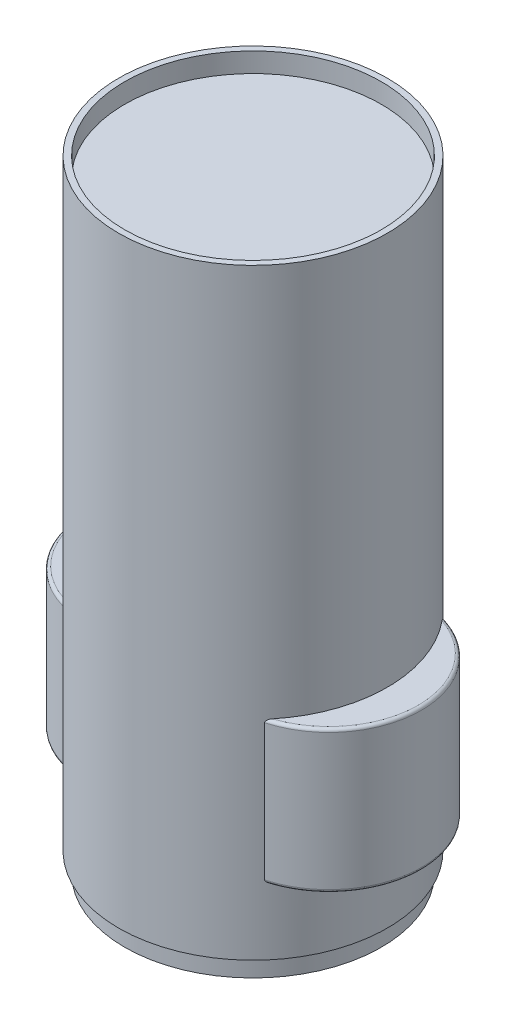
ISO-10303-21;
HEADER;
FILE_DESCRIPTION(('STEP AP214'),'2;1');
FILE_NAME('part.step','',(''),(''),'','','');
FILE_SCHEMA(('AUTOMOTIVE_DESIGN { 1 0 10303 214 1 1 1 1 }'));
ENDSEC;
DATA;
#1=APPLICATION_CONTEXT('core data for automotive mechanical design processes');
#2=APPLICATION_PROTOCOL_DEFINITION('international standard','automotive_design',2000,#1);
#3=PRODUCT_CONTEXT('',#1,'mechanical');
#4=PRODUCT('Part','Part','',(#3));
#5=PRODUCT_RELATED_PRODUCT_CATEGORY('part','',(#4));
#6=PRODUCT_DEFINITION_FORMATION('','',#4);
#7=PRODUCT_DEFINITION_CONTEXT('part definition',#1,'design');
#8=PRODUCT_DEFINITION('design','',#6,#7);
#9=PRODUCT_DEFINITION_SHAPE('','',#8);
#10=(LENGTH_UNIT() NAMED_UNIT(*) SI_UNIT(.MILLI.,.METRE.));
#11=(NAMED_UNIT(*) PLANE_ANGLE_UNIT() SI_UNIT($,.RADIAN.));
#12=(NAMED_UNIT(*) SI_UNIT($,.STERADIAN.) SOLID_ANGLE_UNIT());
#13=UNCERTAINTY_MEASURE_WITH_UNIT(LENGTH_MEASURE(1.E-05),#10,'distance_accuracy_value','');
#14=(GEOMETRIC_REPRESENTATION_CONTEXT(3) GLOBAL_UNCERTAINTY_ASSIGNED_CONTEXT((#13)) GLOBAL_UNIT_ASSIGNED_CONTEXT((#10,
#11,#12)) REPRESENTATION_CONTEXT('',''));
#15=CARTESIAN_POINT('',(0.,0.,0.));
#16=DIRECTION('',(0.,0.,1.));
#17=DIRECTION('',(1.,0.,0.));
#18=AXIS2_PLACEMENT_3D('',#15,#16,#17);
#19=CARTESIAN_POINT('',(0.,199.3,0.));
#20=DIRECTION('',(0.,1.,0.));
#21=DIRECTION('',(0.,0.,1.));
#22=AXIS2_PLACEMENT_3D('',#19,#20,#21);
#23=CYLINDRICAL_SURFACE('',#22,44.5);
#24=CARTESIAN_POINT('',(0.,205.8,0.));
#25=DIRECTION('',(0.,1.,0.));
#26=DIRECTION('',(0.,0.,1.));
#27=AXIS2_PLACEMENT_3D('',#24,#25,#26);
#28=CIRCLE('',#27,44.5);
#29=CARTESIAN_POINT('',(0.,205.8,44.5));
#30=VERTEX_POINT('',#29);
#31=EDGE_CURVE('E183',#30,#30,#28,.T.);
#32=ORIENTED_EDGE('',*,*,#31,.F.);
#33=EDGE_LOOP('',(#32));
#34=FACE_BOUND('',#33,.T.);
#35=CARTESIAN_POINT('',(0.,6.49999999999998,0.));
#36=DIRECTION('',(0.,1.,0.));
#37=DIRECTION('',(0.,0.,1.));
#38=AXIS2_PLACEMENT_3D('',#35,#36,#37);
#39=CIRCLE('',#38,44.5);
#40=CARTESIAN_POINT('',(0.,6.49999999999997,44.5));
#41=VERTEX_POINT('',#40);
#42=EDGE_CURVE('E186',#41,#41,#39,.T.);
#43=ORIENTED_EDGE('',*,*,#42,.T.);
#44=EDGE_LOOP('',(#43));
#45=FACE_BOUND('',#44,.T.);
#46=DIRECTION('',(0.,-1.,0.));
#47=VECTOR('',#46,1.);
#48=CARTESIAN_POINT('',(33.3282803180915,52.035,29.4868738770104));
#49=LINE('',#48,#47);
#50=CARTESIAN_POINT('',(33.3282803180915,74.57,29.4868738770104));
#51=VERTEX_POINT('',#50);
#52=CARTESIAN_POINT('',(33.3282803180915,29.5,29.4868738770104));
#53=VERTEX_POINT('',#52);
#54=EDGE_CURVE('E201',#51,#53,#49,.T.);
#55=ORIENTED_EDGE('',*,*,#54,.F.);
#56=CARTESIAN_POINT('',(33.3282803180915,74.57,29.4868738770104));
#57=CARTESIAN_POINT('',(33.3282290648274,74.6026941237317,29.4869303399323));
#58=CARTESIAN_POINT('',(33.3302284768937,74.6352940124547,29.4846719704872));
#59=CARTESIAN_POINT('',(33.3378637860314,74.6991919996134,29.4760393006147));
#60=CARTESIAN_POINT('',(33.3434638686415,74.7304997219744,29.4697055360972));
#61=CARTESIAN_POINT('',(33.3594192153649,74.7980036695551,29.4516436502028));
#62=CARTESIAN_POINT('',(33.370544747942,74.8337785634002,29.4390408183785));
#63=CARTESIAN_POINT('',(33.396485341139,74.9022007333026,29.409609914728));
#64=CARTESIAN_POINT('',(33.4113149859387,74.9348349226258,29.392765138918));
#65=CARTESIAN_POINT('',(33.4516346665935,75.0119389908455,29.346881596507));
#66=CARTESIAN_POINT('',(33.4787878172227,75.0543735176097,29.3159120704458));
#67=CARTESIAN_POINT('',(33.5368766703659,75.1324837514766,29.2494421360369));
#68=CARTESIAN_POINT('',(33.5678191018013,75.1681471396393,29.2139336624827));
#69=CARTESIAN_POINT('',(33.6276500485631,75.2290649353552,29.1450328354835));
#70=CARTESIAN_POINT('',(33.6562287820361,75.2550769395084,29.1120293654524));
#71=CARTESIAN_POINT('',(33.7146426992063,75.3032701830073,29.0443604457293));
#72=CARTESIAN_POINT('',(33.7444787823177,75.3254486202009,29.0096938037871));
#73=CARTESIAN_POINT('',(33.8355193205995,75.3870399433358,28.9035689894966));
#74=CARTESIAN_POINT('',(33.8980431408311,75.4213051613941,28.8302307541396));
#75=CARTESIAN_POINT('',(34.0079639573205,75.4709328743049,28.7004118095175));
#76=CARTESIAN_POINT('',(34.0550148833266,75.4888966803664,28.6445699545817));
#77=CARTESIAN_POINT('',(34.1496142551314,75.5192581407077,28.5317237699701));
#78=CARTESIAN_POINT('',(34.1971630299818,75.531651840051,28.4747186442662));
#79=CARTESIAN_POINT('',(34.2915505944723,75.5510828137592,28.360975315293));
#80=CARTESIAN_POINT('',(34.3383870002181,75.5582112864938,28.3042503438402));
#81=CARTESIAN_POINT('',(34.431898756543,75.5676543482635,28.1904201735461));
#82=CARTESIAN_POINT('',(34.478574245033,75.5699766769948,28.1333157348268));
#83=CARTESIAN_POINT('',(34.5250994035786,75.57,28.0761021363903));
#84=B_SPLINE_CURVE_WITH_KNOTS('',3,(#56,#57,#58,#59,#60,#61,#62,#63,#64,#65,#66,#67,#68,#69,#70,
#71,#72,#73,#74,#75,#76,#77,#78,#79,#80,#81,#82,#83),.UNSPECIFIED.,.F.,.F.,(4,2,2,2,2,2,2,2,2,2,
2,2,2,4),(0.,0.0977907833194195,0.194623619100568,0.312556690935294,0.430961628564803,
0.607381289542884,0.784118903501161,0.936359281983716,1.08871047450898,1.39455002030677,
1.61995867637769,1.84552712723387,2.06709051691682,2.28829682783787),.UNSPECIFIED.);
#85=CARTESIAN_POINT('',(34.5250994035785,75.57,28.0761021363903));
#86=VERTEX_POINT('',#85);
#87=EDGE_CURVE('E262',#51,#86,#84,.T.);
#88=ORIENTED_EDGE('',*,*,#87,.T.);
#89=CARTESIAN_POINT('',(0.,75.57,0.));
#90=DIRECTION('',(0.,-1.,0.));
#91=DIRECTION('',(0.,0.,-1.));
#92=AXIS2_PLACEMENT_3D('',#89,#90,#91);
#93=CIRCLE('',#92,44.5);
#94=CARTESIAN_POINT('',(34.5250994035785,75.57,-28.0761021363903));
#95=VERTEX_POINT('',#94);
#96=EDGE_CURVE('E200',#86,#95,#93,.F.);
#97=ORIENTED_EDGE('',*,*,#96,.T.);
#98=CARTESIAN_POINT('',(34.5250994035785,75.57,-28.0761021363903));
#99=CARTESIAN_POINT('',(34.471886137988,75.5699594992287,-28.1415416811893));
#100=CARTESIAN_POINT('',(34.4184661535623,75.566930112156,-28.2068487604138));
#101=CARTESIAN_POINT('',(34.3113889509015,75.5545478072244,-28.3370016309063));
#102=CARTESIAN_POINT('',(34.2577315120177,75.5451752217279,-28.4018453516787));
#103=CARTESIAN_POINT('',(34.1504178926029,75.519691929258,-28.5307911176014));
#104=CARTESIAN_POINT('',(34.0967631197051,75.5035470340788,-28.594887679342));
#105=CARTESIAN_POINT('',(33.9902994158401,75.4638607460808,-28.7213570976742));
#106=CARTESIAN_POINT('',(33.9374893288381,75.4403305713274,-28.7837324134913));
#107=CARTESIAN_POINT('',(33.8466803975093,75.3918891807662,-28.8904103855184));
#108=CARTESIAN_POINT('',(33.8083356271671,75.3688568274594,-28.9352690547207));
#109=CARTESIAN_POINT('',(33.7329920912511,75.3174471095592,-29.0230698624084));
#110=CARTESIAN_POINT('',(33.6959933682544,75.2890695760661,-29.0660119402794));
#111=CARTESIAN_POINT('',(33.6238337207307,75.2258820795504,-29.1494574891499));
#112=CARTESIAN_POINT('',(33.5886899967836,75.1910221530623,-29.1899385354299));
#113=CARTESIAN_POINT('',(33.5219136178637,75.1139527204496,-29.266599871983));
#114=CARTESIAN_POINT('',(33.4902726723159,75.0717612035702,-29.3027903325259));
#115=CARTESIAN_POINT('',(33.4442255225117,74.9974912433359,-29.3553143046088));
#116=CARTESIAN_POINT('',(33.427979634385,74.9680937562659,-29.3738095103277));
#117=CARTESIAN_POINT('',(33.3982889739881,74.9061176044222,-29.4075635929464));
#118=CARTESIAN_POINT('',(33.384844802923,74.8735382590694,-29.4228217752439));
#119=CARTESIAN_POINT('',(33.3615321712417,74.8049792472937,-29.4492527673272));
#120=CARTESIAN_POINT('',(33.3517118060886,74.7689613136333,-29.4603706432227));
#121=CARTESIAN_POINT('',(33.3369283456302,74.6947536654882,-29.4770985480268));
#122=CARTESIAN_POINT('',(33.3319471321069,74.6565726228997,-29.4827291221386));
#123=CARTESIAN_POINT('',(33.3292193392278,74.6101066554781,-29.4858124833861));
#124=CARTESIAN_POINT('',(33.3288674390376,74.6020923627154,-29.4862102513128));
#125=CARTESIAN_POINT('',(33.3283983710121,74.586053172617,-29.4867404526471));
#126=CARTESIAN_POINT('',(33.3282810559128,74.5780282851008,-29.4868730525174));
#127=CARTESIAN_POINT('',(33.3282803180915,74.57,-29.4868738770104));
#128=B_SPLINE_CURVE_WITH_KNOTS('',3,(#98,#99,#100,#101,#102,#103,#104,#105,#106,#107,#108,#109,
#110,#111,#112,#113,#114,#115,#116,#117,#118,#119,#120,#121,#122,#123,#124,#125,#126,#127),
.UNSPECIFIED.,.F.,.F.,(4,2,2,2,2,2,2,2,2,2,2,2,2,2,4),(0.,0.253023706346703,0.50683555079611,
0.761944417442202,1.0166676399544,1.20650028717804,1.39633893383444,1.5877064596561,
1.77861089874805,1.89335142921242,2.00811655592235,2.12435429681833,2.24015513641538,
2.26424639201346,2.28832251924724),.UNSPECIFIED.);
#129=CARTESIAN_POINT('',(33.3282803180915,74.57,-29.4868738770104));
#130=VERTEX_POINT('',#129);
#131=EDGE_CURVE('E268',#95,#130,#128,.T.);
#132=ORIENTED_EDGE('',*,*,#131,.T.);
#133=DIRECTION('',(0.,-1.,0.));
#134=VECTOR('',#133,1.);
#135=CARTESIAN_POINT('',(33.3282803180915,52.035,-29.4868738770104));
#136=LINE('',#135,#134);
#137=CARTESIAN_POINT('',(33.3282803180915,29.5,-29.4868738770104));
#138=VERTEX_POINT('',#137);
#139=EDGE_CURVE('E204',#138,#130,#136,.F.);
#140=ORIENTED_EDGE('',*,*,#139,.F.);
#141=CARTESIAN_POINT('',(33.3282803180915,29.5,-29.4868738770104));
#142=CARTESIAN_POINT('',(33.3282290648274,29.4673058762683,-29.4869303399324));
#143=CARTESIAN_POINT('',(33.3302284768936,29.4347059875453,-29.4846719704872));
#144=CARTESIAN_POINT('',(33.3378637860314,29.3708080003866,-29.4760393006147));
#145=CARTESIAN_POINT('',(33.3434638686415,29.3395002780256,-29.4697055360972));
#146=CARTESIAN_POINT('',(33.3594192153649,29.2719963304449,-29.4516436502028));
#147=CARTESIAN_POINT('',(33.370544747942,29.2362214365998,-29.4390408183785));
#148=CARTESIAN_POINT('',(33.396485341139,29.1677992666973,-29.409609914728));
#149=CARTESIAN_POINT('',(33.4113149859387,29.1351650773742,-29.3927651389181));
#150=CARTESIAN_POINT('',(33.4516346665935,29.0580610091545,-29.3468815965071));
#151=CARTESIAN_POINT('',(33.4787878172227,29.0156264823903,-29.3159120704458));
#152=CARTESIAN_POINT('',(33.5368766703659,28.9375162485234,-29.2494421360369));
#153=CARTESIAN_POINT('',(33.5678191018013,28.9018528603607,-29.2139336624827));
#154=CARTESIAN_POINT('',(33.6276500485631,28.8409350646448,-29.1450328354835));
#155=CARTESIAN_POINT('',(33.6562287820361,28.8149230604916,-29.1120293654524));
#156=CARTESIAN_POINT('',(33.7146426992063,28.7667298169927,-29.0443604457293));
#157=CARTESIAN_POINT('',(33.7444787823177,28.7445513797991,-29.0096938037871));
#158=CARTESIAN_POINT('',(33.8355193205995,28.6829600566642,-28.9035689894966));
#159=CARTESIAN_POINT('',(33.898043140831,28.6486948386059,-28.8302307541397));
#160=CARTESIAN_POINT('',(34.0079639573205,28.5990671256951,-28.7004118095175));
#161=CARTESIAN_POINT('',(34.0550148833266,28.5811033196336,-28.6445699545817));
#162=CARTESIAN_POINT('',(34.1496142551314,28.5507418592922,-28.5317237699702));
#163=CARTESIAN_POINT('',(34.1971630299818,28.538348159949,-28.4747186442662));
#164=CARTESIAN_POINT('',(34.2915505944723,28.5189171862408,-28.360975315293));
#165=CARTESIAN_POINT('',(34.338387000218,28.5117887135062,-28.3042503438402));
#166=CARTESIAN_POINT('',(34.431898756543,28.5023456517365,-28.1904201735462));
#167=CARTESIAN_POINT('',(34.478574245033,28.5000233230052,-28.1333157348268));
#168=CARTESIAN_POINT('',(34.5250994035785,28.5,-28.0761021363903));
#169=B_SPLINE_CURVE_WITH_KNOTS('',3,(#141,#142,#143,#144,#145,#146,#147,#148,#149,#150,#151,
#152,#153,#154,#155,#156,#157,#158,#159,#160,#161,#162,#163,#164,#165,#166,#167,#168),
.UNSPECIFIED.,.F.,.F.,(4,2,2,2,2,2,2,2,2,2,2,2,2,4),(0.,0.0977907833194221,0.194623619100572,
0.312556690935311,0.430961628564806,0.607381289542887,0.784118903501163,0.936359281983706,
1.08871047450897,1.39455002030677,1.61995867637769,1.84552712723387,2.06709051691681,
2.28829682783787),.UNSPECIFIED.);
#170=CARTESIAN_POINT('',(34.5250994035785,28.5,-28.0761021363903));
#171=VERTEX_POINT('',#170);
#172=EDGE_CURVE('E240',#138,#171,#169,.T.);
#173=ORIENTED_EDGE('',*,*,#172,.T.);
#174=CARTESIAN_POINT('',(0.,28.5,0.));
#175=DIRECTION('',(0.,-1.,0.));
#176=DIRECTION('',(0.,0.,-1.));
#177=AXIS2_PLACEMENT_3D('',#174,#175,#176);
#178=CIRCLE('',#177,44.5);
#179=CARTESIAN_POINT('',(34.5250994035786,28.5,28.0761021363903));
#180=VERTEX_POINT('',#179);
#181=EDGE_CURVE('E195',#180,#171,#178,.F.);
#182=ORIENTED_EDGE('',*,*,#181,.F.);
#183=CARTESIAN_POINT('',(34.5250994035785,28.5,28.0761021363903));
#184=CARTESIAN_POINT('',(34.4718861379881,28.5000405007713,28.1415416811893));
#185=CARTESIAN_POINT('',(34.4184661535623,28.503069887844,28.2068487604138));
#186=CARTESIAN_POINT('',(34.3113889509015,28.5154521927756,28.3370016309063));
#187=CARTESIAN_POINT('',(34.2577315120177,28.5248247782721,28.4018453516786));
#188=CARTESIAN_POINT('',(34.1504178926029,28.550308070742,28.5307911176014));
#189=CARTESIAN_POINT('',(34.0967631197051,28.5664529659212,28.594887679342));
#190=CARTESIAN_POINT('',(33.9902994158401,28.6061392539192,28.7213570976741));
#191=CARTESIAN_POINT('',(33.9374893288382,28.6296694286726,28.7837324134913));
#192=CARTESIAN_POINT('',(33.8466803975093,28.6781108192338,28.8904103855184));
#193=CARTESIAN_POINT('',(33.8083356271672,28.7011431725406,28.9352690547207));
#194=CARTESIAN_POINT('',(33.7329920912511,28.7525528904408,29.0230698624084));
#195=CARTESIAN_POINT('',(33.6959933682544,28.7809304239339,29.0660119402794));
#196=CARTESIAN_POINT('',(33.6238337207308,28.8441179204496,29.1494574891499));
#197=CARTESIAN_POINT('',(33.5886899967836,28.8789778469376,29.1899385354299));
#198=CARTESIAN_POINT('',(33.5219136178638,28.9560472795504,29.266599871983));
#199=CARTESIAN_POINT('',(33.4902726723159,28.9982387964297,29.3027903325258));
#200=CARTESIAN_POINT('',(33.4442255225117,29.0725087566641,29.3553143046088));
#201=CARTESIAN_POINT('',(33.427979634385,29.1019062437341,29.3738095103276));
#202=CARTESIAN_POINT('',(33.3982889739881,29.1638823955777,29.4075635929464));
#203=CARTESIAN_POINT('',(33.384844802923,29.1964617409306,29.4228217752438));
#204=CARTESIAN_POINT('',(33.3615321712417,29.2650207527063,29.4492527673272));
#205=CARTESIAN_POINT('',(33.3517118060886,29.3010386863667,29.4603706432227));
#206=CARTESIAN_POINT('',(33.3369283456302,29.3752463345118,29.4770985480268));
#207=CARTESIAN_POINT('',(33.3319471321069,29.4134273771003,29.4827291221386));
#208=CARTESIAN_POINT('',(33.3292193392278,29.4598933445218,29.4858124833861));
#209=CARTESIAN_POINT('',(33.3288674390376,29.4679076372845,29.4862102513128));
#210=CARTESIAN_POINT('',(33.3283983710121,29.483946827383,29.4867404526471));
#211=CARTESIAN_POINT('',(33.3282810559129,29.4919717148992,29.4868730525174));
#212=CARTESIAN_POINT('',(33.3282803180915,29.5,29.4868738770104));
#213=B_SPLINE_CURVE_WITH_KNOTS('',3,(#183,#184,#185,#186,#187,#188,#189,#190,#191,#192,#193,
#194,#195,#196,#197,#198,#199,#200,#201,#202,#203,#204,#205,#206,#207,#208,#209,#210,#211,#212),
.UNSPECIFIED.,.F.,.F.,(4,2,2,2,2,2,2,2,2,2,2,2,2,2,4),(0.,0.253023706346701,0.50683555079612,
0.761944417442207,1.0166676399544,1.20650028717802,1.39633893383443,1.58770645965609,
1.77861089874804,1.8933514292124,2.00811655592233,2.1243542968183,2.24015513641535,
2.26424639201344,2.28832251924726),.UNSPECIFIED.);
#214=EDGE_CURVE('E234',#180,#53,#213,.T.);
#215=ORIENTED_EDGE('',*,*,#214,.T.);
#216=EDGE_LOOP('',(#55,#88,#97,#132,#140,#173,#182,#215));
#217=FACE_BOUND('',#216,.T.);
#218=CARTESIAN_POINT('',(0.,175.57,0.));
#219=DIRECTION('',(0.,-1.,0.));
#220=DIRECTION('',(0.,0.,1.));
#221=AXIS2_PLACEMENT_3D('',#218,#219,#220);
#222=CIRCLE('',#221,44.5);
#223=CARTESIAN_POINT('',(-44.2097122743787,175.57,5.07457787571034));
#224=VERTEX_POINT('',#223);
#225=CARTESIAN_POINT('',(-44.2097122743787,175.57,-5.07457787571028));
#226=VERTEX_POINT('',#225);
#227=EDGE_CURVE('E403',#224,#226,#222,.T.);
#228=ORIENTED_EDGE('',*,*,#227,.F.);
#229=DIRECTION('',(0.,-1.,0.));
#230=VECTOR('',#229,1.);
#231=CARTESIAN_POINT('',(-44.2097122743787,175.57,5.07457787571032));
#232=LINE('',#231,#230);
#233=CARTESIAN_POINT('',(-44.2097122743787,75.57,5.0745778757103));
#234=VERTEX_POINT('',#233);
#235=EDGE_CURVE('E173',#224,#234,#232,.T.);
#236=ORIENTED_EDGE('',*,*,#235,.T.);
#237=CARTESIAN_POINT('',(-34.5250994035785,75.57,28.0761021363903));
#238=VERTEX_POINT('',#237);
#239=EDGE_CURVE('E210',#234,#238,#93,.F.);
#240=ORIENTED_EDGE('',*,*,#239,.T.);
#241=CARTESIAN_POINT('',(-34.5250994035785,75.57,28.0761021363903));
#242=CARTESIAN_POINT('',(-34.4718861379881,75.5699594992286,28.1415416811893));
#243=CARTESIAN_POINT('',(-34.4184661535623,75.566930112156,28.2068487604138));
#244=CARTESIAN_POINT('',(-34.3113889509015,75.5545478072243,28.3370016309063));
#245=CARTESIAN_POINT('',(-34.2577315120177,75.5451752217279,28.4018453516786));
#246=CARTESIAN_POINT('',(-34.1504178926029,75.519691929258,28.5307911176014));
#247=CARTESIAN_POINT('',(-34.0967631197051,75.5035470340788,28.594887679342));
#248=CARTESIAN_POINT('',(-33.9902994158401,75.4638607460808,28.7213570976742));
#249=CARTESIAN_POINT('',(-33.9374893288381,75.4403305713274,28.7837324134913));
#250=CARTESIAN_POINT('',(-33.8466803975093,75.3918891807662,28.8904103855184));
#251=CARTESIAN_POINT('',(-33.8083356271672,75.3688568274594,28.9352690547207));
#252=CARTESIAN_POINT('',(-33.7329920912511,75.3174471095592,29.0230698624084));
#253=CARTESIAN_POINT('',(-33.6959933682544,75.2890695760661,29.0660119402794));
#254=CARTESIAN_POINT('',(-33.6238337207308,75.2258820795504,29.1494574891499));
#255=CARTESIAN_POINT('',(-33.5886899967836,75.1910221530623,29.1899385354299));
#256=CARTESIAN_POINT('',(-33.5219136178638,75.1139527204496,29.266599871983));
#257=CARTESIAN_POINT('',(-33.4902726723159,75.0717612035703,29.3027903325258));
#258=CARTESIAN_POINT('',(-33.4442255225117,74.9974912433359,29.3553143046088));
#259=CARTESIAN_POINT('',(-33.427979634385,74.9680937562659,29.3738095103276));
#260=CARTESIAN_POINT('',(-33.3982889739881,74.9061176044223,29.4075635929464));
#261=CARTESIAN_POINT('',(-33.384844802923,74.8735382590694,29.4228217752438));
#262=CARTESIAN_POINT('',(-33.3615321712417,74.8049792472937,29.4492527673272));
#263=CARTESIAN_POINT('',(-33.3517118060886,74.7689613136333,29.4603706432227));
#264=CARTESIAN_POINT('',(-33.3369283456302,74.6947536654882,29.4770985480268));
#265=CARTESIAN_POINT('',(-33.3319471321069,74.6565726228997,29.4827291221386));
#266=CARTESIAN_POINT('',(-33.3292193392278,74.6101066554781,29.4858124833861));
#267=CARTESIAN_POINT('',(-33.3288674390376,74.6020923627155,29.4862102513128));
#268=CARTESIAN_POINT('',(-33.3283983710121,74.586053172617,29.4867404526471));
#269=CARTESIAN_POINT('',(-33.3282810559129,74.5780282851008,29.4868730525174));
#270=CARTESIAN_POINT('',(-33.3282803180915,74.57,29.4868738770104));
#271=B_SPLINE_CURVE_WITH_KNOTS('',3,(#241,#242,#243,#244,#245,#246,#247,#248,#249,#250,#251,
#252,#253,#254,#255,#256,#257,#258,#259,#260,#261,#262,#263,#264,#265,#266,#267,#268,#269,#270),
.UNSPECIFIED.,.F.,.F.,(4,2,2,2,2,2,2,2,2,2,2,2,2,2,4),(0.,0.253023706346694,0.506835550796111,
0.761944417442205,1.0166676399544,1.20650028717803,1.39633893383442,1.58770645965607,
1.77861089874802,1.89335142921238,2.0081165559223,2.1243542968183,2.24015513641536,
2.26424639201345,2.28832251924727),.UNSPECIFIED.);
#272=CARTESIAN_POINT('',(-33.3282803180915,74.57,29.4868738770104));
#273=VERTEX_POINT('',#272);
#274=EDGE_CURVE('E11',#238,#273,#271,.T.);
#275=ORIENTED_EDGE('',*,*,#274,.T.);
#276=DIRECTION('',(0.,-1.,0.));
#277=VECTOR('',#276,1.);
#278=CARTESIAN_POINT('',(-33.3282803180915,52.035,29.4868738770104));
#279=LINE('',#278,#277);
#280=CARTESIAN_POINT('',(-33.3282803180915,29.5,29.4868738770104));
#281=VERTEX_POINT('',#280);
#282=EDGE_CURVE('E213',#281,#273,#279,.F.);
#283=ORIENTED_EDGE('',*,*,#282,.F.);
#284=CARTESIAN_POINT('',(-33.3282803180915,29.5,29.4868738770104));
#285=CARTESIAN_POINT('',(-33.3282290648274,29.4673058762683,29.4869303399323));
#286=CARTESIAN_POINT('',(-33.3302284768937,29.4347059875453,29.4846719704872));
#287=CARTESIAN_POINT('',(-33.3378637860314,29.3708080003866,29.4760393006147));
#288=CARTESIAN_POINT('',(-33.3434638686415,29.3395002780256,29.4697055360972));
#289=CARTESIAN_POINT('',(-33.3594192153649,29.2719963304449,29.4516436502028));
#290=CARTESIAN_POINT('',(-33.370544747942,29.2362214365998,29.4390408183785));
#291=CARTESIAN_POINT('',(-33.396485341139,29.1677992666973,29.409609914728));
#292=CARTESIAN_POINT('',(-33.4113149859387,29.1351650773742,29.392765138918));
#293=CARTESIAN_POINT('',(-33.4516346665935,29.0580610091545,29.346881596507));
#294=CARTESIAN_POINT('',(-33.4787878172227,29.0156264823903,29.3159120704458));
#295=CARTESIAN_POINT('',(-33.5368766703659,28.9375162485234,29.2494421360369));
#296=CARTESIAN_POINT('',(-33.5678191018013,28.9018528603607,29.2139336624827));
#297=CARTESIAN_POINT('',(-33.6276500485631,28.8409350646448,29.1450328354835));
#298=CARTESIAN_POINT('',(-33.6562287820361,28.8149230604916,29.1120293654524));
#299=CARTESIAN_POINT('',(-33.7146426992063,28.7667298169927,29.0443604457293));
#300=CARTESIAN_POINT('',(-33.7444787823177,28.7445513797991,29.0096938037871));
#301=CARTESIAN_POINT('',(-33.8355193205995,28.6829600566642,28.9035689894966));
#302=CARTESIAN_POINT('',(-33.898043140831,28.6486948386059,28.8302307541397));
#303=CARTESIAN_POINT('',(-34.0079639573205,28.5990671256951,28.7004118095175));
#304=CARTESIAN_POINT('',(-34.0550148833266,28.5811033196336,28.6445699545817));
#305=CARTESIAN_POINT('',(-34.1496142551314,28.5507418592922,28.5317237699701));
#306=CARTESIAN_POINT('',(-34.1971630299818,28.538348159949,28.4747186442662));
#307=CARTESIAN_POINT('',(-34.2915505944723,28.5189171862408,28.360975315293));
#308=CARTESIAN_POINT('',(-34.3383870002181,28.5117887135062,28.3042503438402));
#309=CARTESIAN_POINT('',(-34.431898756543,28.5023456517365,28.1904201735461));
#310=CARTESIAN_POINT('',(-34.478574245033,28.5000233230052,28.1333157348268));
#311=CARTESIAN_POINT('',(-34.5250994035785,28.5,28.0761021363903));
#312=B_SPLINE_CURVE_WITH_KNOTS('',3,(#284,#285,#286,#287,#288,#289,#290,#291,#292,#293,#294,
#295,#296,#297,#298,#299,#300,#301,#302,#303,#304,#305,#306,#307,#308,#309,#310,#311),
.UNSPECIFIED.,.F.,.F.,(4,2,2,2,2,2,2,2,2,2,2,2,2,4),(0.,0.0977907833194227,0.194623619100574,
0.312556690935314,0.430961628564804,0.607381289542881,0.784118903501155,0.9363592819837,
1.08871047450897,1.39455002030675,1.61995867637767,1.84552712723386,2.06709051691681,
2.28829682783787),.UNSPECIFIED.);
#313=CARTESIAN_POINT('',(-34.5250994035786,28.5,28.0761021363903));
#314=VERTEX_POINT('',#313);
#315=EDGE_CURVE('E280',#281,#314,#312,.T.);
#316=ORIENTED_EDGE('',*,*,#315,.T.);
#317=CARTESIAN_POINT('',(-34.5250994035785,28.5,-28.0761021363903));
#318=VERTEX_POINT('',#317);
#319=EDGE_CURVE('E196',#318,#314,#178,.F.);
#320=ORIENTED_EDGE('',*,*,#319,.F.);
#321=CARTESIAN_POINT('',(-34.5250994035785,28.5,-28.0761021363903));
#322=CARTESIAN_POINT('',(-34.471886137988,28.5000405007713,-28.1415416811893));
#323=CARTESIAN_POINT('',(-34.4184661535623,28.503069887844,-28.2068487604138));
#324=CARTESIAN_POINT('',(-34.3113889509015,28.5154521927757,-28.3370016309063));
#325=CARTESIAN_POINT('',(-34.2577315120177,28.5248247782721,-28.4018453516787));
#326=CARTESIAN_POINT('',(-34.1504178926029,28.550308070742,-28.5307911176014));
#327=CARTESIAN_POINT('',(-34.0967631197051,28.5664529659212,-28.594887679342));
#328=CARTESIAN_POINT('',(-33.9902994158401,28.6061392539192,-28.7213570976742));
#329=CARTESIAN_POINT('',(-33.9374893288381,28.6296694286726,-28.7837324134913));
#330=CARTESIAN_POINT('',(-33.8466803975093,28.6781108192338,-28.8904103855184));
#331=CARTESIAN_POINT('',(-33.8083356271671,28.7011431725406,-28.9352690547207));
#332=CARTESIAN_POINT('',(-33.7329920912511,28.7525528904408,-29.0230698624084));
#333=CARTESIAN_POINT('',(-33.6959933682544,28.7809304239339,-29.0660119402794));
#334=CARTESIAN_POINT('',(-33.6238337207307,28.8441179204496,-29.1494574891499));
#335=CARTESIAN_POINT('',(-33.5886899967836,28.8789778469377,-29.1899385354299));
#336=CARTESIAN_POINT('',(-33.5219136178637,28.9560472795504,-29.266599871983));
#337=CARTESIAN_POINT('',(-33.4902726723159,28.9982387964297,-29.3027903325259));
#338=CARTESIAN_POINT('',(-33.4442255225117,29.0725087566641,-29.3553143046088));
#339=CARTESIAN_POINT('',(-33.427979634385,29.1019062437342,-29.3738095103277));
#340=CARTESIAN_POINT('',(-33.3982889739881,29.1638823955778,-29.4075635929464));
#341=CARTESIAN_POINT('',(-33.384844802923,29.1964617409306,-29.4228217752439));
#342=CARTESIAN_POINT('',(-33.3615321712417,29.2650207527063,-29.4492527673272));
#343=CARTESIAN_POINT('',(-33.3517118060886,29.3010386863667,-29.4603706432227));
#344=CARTESIAN_POINT('',(-33.3369283456302,29.3752463345118,-29.4770985480269));
#345=CARTESIAN_POINT('',(-33.3319471321069,29.4134273771003,-29.4827291221386));
#346=CARTESIAN_POINT('',(-33.3292193392278,29.4598933445219,-29.4858124833861));
#347=CARTESIAN_POINT('',(-33.3288674390376,29.4679076372846,-29.4862102513128));
#348=CARTESIAN_POINT('',(-33.3283983710121,29.483946827383,-29.4867404526471));
#349=CARTESIAN_POINT('',(-33.3282810559128,29.4919717148992,-29.4868730525174));
#350=CARTESIAN_POINT('',(-33.3282803180915,29.5,-29.4868738770104));
#351=B_SPLINE_CURVE_WITH_KNOTS('',3,(#321,#322,#323,#324,#325,#326,#327,#328,#329,#330,#331,
#332,#333,#334,#335,#336,#337,#338,#339,#340,#341,#342,#343,#344,#345,#346,#347,#348,#349,#350),
.UNSPECIFIED.,.F.,.F.,(4,2,2,2,2,2,2,2,2,2,2,2,2,2,4),(0.,0.253023706346706,0.50683555079611,
0.761944417442204,1.0166676399544,1.20650028717803,1.39633893383444,1.5877064596561,
1.77861089874805,1.89335142921242,2.00811655592234,2.12435429681832,2.24015513641538,
2.26424639201346,2.28832251924726),.UNSPECIFIED.);
#352=CARTESIAN_POINT('',(-33.3282803180915,29.5,-29.4868738770104));
#353=VERTEX_POINT('',#352);
#354=EDGE_CURVE('E274',#318,#353,#351,.T.);
#355=ORIENTED_EDGE('',*,*,#354,.T.);
#356=DIRECTION('',(0.,-1.,0.));
#357=VECTOR('',#356,1.);
#358=CARTESIAN_POINT('',(-33.3282803180915,52.035,-29.4868738770104));
#359=LINE('',#358,#357);
#360=CARTESIAN_POINT('',(-33.3282803180915,74.57,-29.4868738770104));
#361=VERTEX_POINT('',#360);
#362=EDGE_CURVE('E199',#361,#353,#359,.T.);
#363=ORIENTED_EDGE('',*,*,#362,.F.);
#364=CARTESIAN_POINT('',(-33.3282803180915,74.57,-29.4868738770104));
#365=CARTESIAN_POINT('',(-33.3282290648274,74.6026941237317,-29.4869303399323));
#366=CARTESIAN_POINT('',(-33.3302284768936,74.6352940124547,-29.4846719704872));
#367=CARTESIAN_POINT('',(-33.3378637860314,74.6991919996134,-29.4760393006147));
#368=CARTESIAN_POINT('',(-33.3434638686415,74.7304997219744,-29.4697055360972));
#369=CARTESIAN_POINT('',(-33.3594192153649,74.7980036695551,-29.4516436502028));
#370=CARTESIAN_POINT('',(-33.370544747942,74.8337785634002,-29.4390408183785));
#371=CARTESIAN_POINT('',(-33.396485341139,74.9022007333026,-29.409609914728));
#372=CARTESIAN_POINT('',(-33.4113149859387,74.9348349226258,-29.3927651389181));
#373=CARTESIAN_POINT('',(-33.4516346665934,75.0119389908455,-29.3468815965071));
#374=CARTESIAN_POINT('',(-33.4787878172227,75.0543735176097,-29.3159120704458));
#375=CARTESIAN_POINT('',(-33.5368766703659,75.1324837514765,-29.2494421360369));
#376=CARTESIAN_POINT('',(-33.5678191018012,75.1681471396393,-29.2139336624827));
#377=CARTESIAN_POINT('',(-33.6276500485631,75.2290649353552,-29.1450328354835));
#378=CARTESIAN_POINT('',(-33.6562287820361,75.2550769395084,-29.1120293654524));
#379=CARTESIAN_POINT('',(-33.7146426992063,75.3032701830073,-29.0443604457293));
#380=CARTESIAN_POINT('',(-33.7444787823177,75.3254486202009,-29.0096938037871));
#381=CARTESIAN_POINT('',(-33.8355193205995,75.3870399433358,-28.9035689894966));
#382=CARTESIAN_POINT('',(-33.898043140831,75.4213051613941,-28.8302307541397));
#383=CARTESIAN_POINT('',(-34.0079639573205,75.4709328743049,-28.7004118095175));
#384=CARTESIAN_POINT('',(-34.0550148833266,75.4888966803664,-28.6445699545818));
#385=CARTESIAN_POINT('',(-34.1496142551313,75.5192581407077,-28.5317237699702));
#386=CARTESIAN_POINT('',(-34.1971630299818,75.531651840051,-28.4747186442663));
#387=CARTESIAN_POINT('',(-34.2915505944723,75.5510828137592,-28.360975315293));
#388=CARTESIAN_POINT('',(-34.338387000218,75.5582112864938,-28.3042503438402));
#389=CARTESIAN_POINT('',(-34.431898756543,75.5676543482635,-28.1904201735462));
#390=CARTESIAN_POINT('',(-34.478574245033,75.5699766769948,-28.1333157348268));
#391=CARTESIAN_POINT('',(-34.5250994035785,75.57,-28.0761021363903));
#392=B_SPLINE_CURVE_WITH_KNOTS('',3,(#364,#365,#366,#367,#368,#369,#370,#371,#372,#373,#374,
#375,#376,#377,#378,#379,#380,#381,#382,#383,#384,#385,#386,#387,#388,#389,#390,#391),
.UNSPECIFIED.,.F.,.F.,(4,2,2,2,2,2,2,2,2,2,2,2,2,4),(0.,0.0977907833194186,0.194623619100568,
0.312556690935294,0.430961628564792,0.607381289542852,0.784118903501126,0.936359281983668,
1.08871047450892,1.39455002030671,1.61995867637765,1.84552712723384,2.0670905169168,
2.28829682783787),.UNSPECIFIED.);
#393=CARTESIAN_POINT('',(-34.5250994035785,75.57,-28.0761021363903));
#394=VERTEX_POINT('',#393);
#395=EDGE_CURVE('E44',#361,#394,#392,.T.);
#396=ORIENTED_EDGE('',*,*,#395,.T.);
#397=CARTESIAN_POINT('',(-44.2097122743787,75.57,-5.07457787571029));
#398=VERTEX_POINT('',#397);
#399=EDGE_CURVE('E207',#394,#398,#93,.F.);
#400=ORIENTED_EDGE('',*,*,#399,.T.);
#401=DIRECTION('',(0.,-1.,0.));
#402=VECTOR('',#401,1.);
#403=CARTESIAN_POINT('',(-44.2097122743787,175.57,-5.07457787571028));
#404=LINE('',#403,#402);
#405=EDGE_CURVE('E170',#226,#398,#404,.T.);
#406=ORIENTED_EDGE('',*,*,#405,.F.);
#407=EDGE_LOOP('',(#228,#236,#240,#275,#283,#316,#320,#355,#363,#396,#400,#406));
#408=FACE_BOUND('',#407,.T.);
#409=ADVANCED_FACE('F31',(#34,#45,#217,#408),#23,.T.);
#410=CARTESIAN_POINT('',(0.,75.57,0.));
#411=DIRECTION('',(0.,-1.,0.));
#412=DIRECTION('',(0.,0.,-1.));
#413=AXIS2_PLACEMENT_3D('',#410,#411,#412);
#414=PLANE('',#413);
#415=ORIENTED_EDGE('',*,*,#399,.F.);
#416=CARTESIAN_POINT('',(-25.15,75.57,0.));
#417=DIRECTION('',(0.,-1.,0.));
#418=DIRECTION('',(0.,0.,-1.));
#419=AXIS2_PLACEMENT_3D('',#416,#417,#418);
#420=CIRCLE('',#419,29.6);
#421=EDGE_CURVE('E51',#394,#238,#420,.F.);
#422=ORIENTED_EDGE('',*,*,#421,.T.);
#423=ORIENTED_EDGE('',*,*,#239,.F.);
#424=CARTESIAN_POINT('',(-44.5574291124918,75.57,5.11449028596872));
#425=DIRECTION('',(0.,-1.,0.));
#426=DIRECTION('',(0.,0.,-1.));
#427=AXIS2_PLACEMENT_3D('',#424,#425,#426);
#428=CIRCLE('',#427,0.350000000000008);
#429=CARTESIAN_POINT('',(-44.9068017265158,75.57,5.0935432916723));
#430=VERTEX_POINT('',#429);
#431=EDGE_CURVE('E140',#430,#234,#428,.T.);
#432=ORIENTED_EDGE('',*,*,#431,.F.);
#433=CARTESIAN_POINT('',(-46.467,75.57,5.00000000000001));
#434=DIRECTION('',(0.,1.,0.));
#435=DIRECTION('',(0.,0.,-1.));
#436=AXIS2_PLACEMENT_3D('',#433,#434,#435);
#437=CIRCLE('',#436,1.563);
#438=CARTESIAN_POINT('',(-48.03,75.57,5.00000000000001));
#439=VERTEX_POINT('',#438);
#440=EDGE_CURVE('E134',#439,#430,#437,.T.);
#441=ORIENTED_EDGE('',*,*,#440,.F.);
#442=DIRECTION('',(0.,0.,1.));
#443=VECTOR('',#442,1.);
#444=CARTESIAN_POINT('',(-48.03,75.57,5.00000000000001));
#445=LINE('',#444,#443);
#446=CARTESIAN_POINT('',(-48.03,75.57,-4.99999999999999));
#447=VERTEX_POINT('',#446);
#448=EDGE_CURVE('E137',#447,#439,#445,.T.);
#449=ORIENTED_EDGE('',*,*,#448,.F.);
#450=CARTESIAN_POINT('',(-46.467,75.57,-4.99999999999999));
#451=DIRECTION('',(0.,1.,0.));
#452=DIRECTION('',(0.,0.,-1.));
#453=AXIS2_PLACEMENT_3D('',#450,#451,#452);
#454=CIRCLE('',#453,1.563);
#455=CARTESIAN_POINT('',(-44.9068017265158,75.57,-5.09354329167228));
#456=VERTEX_POINT('',#455);
#457=EDGE_CURVE('E156',#456,#447,#454,.T.);
#458=ORIENTED_EDGE('',*,*,#457,.F.);
#459=CARTESIAN_POINT('',(-44.5574291124918,75.57,-5.11449028596869));
#460=DIRECTION('',(0.,-1.,0.));
#461=DIRECTION('',(0.,0.,1.));
#462=AXIS2_PLACEMENT_3D('',#459,#460,#461);
#463=CIRCLE('',#462,0.350000000000008);
#464=EDGE_CURVE('E393',#398,#456,#463,.T.);
#465=ORIENTED_EDGE('',*,*,#464,.F.);
#466=EDGE_LOOP('',(#415,#422,#423,#432,#441,#449,#458,#465));
#467=FACE_BOUND('',#466,.T.);
#468=ADVANCED_FACE('F136',(#467),#414,.F.);
#469=CARTESIAN_POINT('',(0.,0.,0.));
#470=DIRECTION('',(0.,-1.,0.));
#471=DIRECTION('',(0.,0.,-1.));
#472=AXIS2_PLACEMENT_3D('',#469,#470,#471);
#473=PLANE('',#472);
#474=CARTESIAN_POINT('',(0.,0.,0.));
#475=DIRECTION('',(0.,1.,0.));
#476=DIRECTION('',(0.,0.,1.));
#477=AXIS2_PLACEMENT_3D('',#474,#475,#476);
#478=CIRCLE('',#477,42.5);
#479=CARTESIAN_POINT('',(0.,0.,42.5));
#480=VERTEX_POINT('',#479);
#481=EDGE_CURVE('E192',#480,#480,#478,.T.);
#482=ORIENTED_EDGE('',*,*,#481,.F.);
#483=EDGE_LOOP('',(#482));
#484=FACE_BOUND('',#483,.T.);
#485=ADVANCED_FACE('F33',(#484),#473,.T.);
#486=CARTESIAN_POINT('',(0.,199.3,0.));
#487=DIRECTION('',(0.,1.,0.));
#488=DIRECTION('',(0.,0.,1.));
#489=AXIS2_PLACEMENT_3D('',#486,#487,#488);
#490=CYLINDRICAL_SURFACE('',#489,42.5);
#491=ORIENTED_EDGE('',*,*,#481,.T.);
#492=EDGE_LOOP('',(#491));
#493=FACE_BOUND('',#492,.T.);
#494=CARTESIAN_POINT('',(0.,6.50000000000001,0.));
#495=DIRECTION('',(0.,1.,0.));
#496=DIRECTION('',(0.,0.,1.));
#497=AXIS2_PLACEMENT_3D('',#494,#495,#496);
#498=CIRCLE('',#497,42.5);
#499=CARTESIAN_POINT('',(0.,6.5,42.5));
#500=VERTEX_POINT('',#499);
#501=EDGE_CURVE('E189',#500,#500,#498,.T.);
#502=ORIENTED_EDGE('',*,*,#501,.F.);
#503=EDGE_LOOP('',(#502));
#504=FACE_BOUND('',#503,.T.);
#505=ADVANCED_FACE('F357',(#493,#504),#490,.T.);
#506=CARTESIAN_POINT('',(0.,6.49999999999999,42.5));
#507=DIRECTION('',(0.,-1.,0.));
#508=DIRECTION('',(0.,0.,-1.));
#509=AXIS2_PLACEMENT_3D('',#506,#507,#508);
#510=PLANE('',#509);
#511=ORIENTED_EDGE('',*,*,#501,.T.);
#512=EDGE_LOOP('',(#511));
#513=FACE_BOUND('',#512,.T.);
#514=ORIENTED_EDGE('',*,*,#42,.F.);
#515=EDGE_LOOP('',(#514));
#516=FACE_BOUND('',#515,.T.);
#517=ADVANCED_FACE('F256',(#513,#516),#510,.T.);
#518=CARTESIAN_POINT('',(0.,205.8,44.5));
#519=DIRECTION('',(0.,1.,0.));
#520=DIRECTION('',(0.,0.,1.));
#521=AXIS2_PLACEMENT_3D('',#518,#519,#520);
#522=PLANE('',#521);
#523=ORIENTED_EDGE('',*,*,#31,.T.);
#524=EDGE_LOOP('',(#523));
#525=FACE_BOUND('',#524,.T.);
#526=CARTESIAN_POINT('',(0.,205.8,0.));
#527=DIRECTION('',(0.,1.,0.));
#528=DIRECTION('',(0.,0.,1.));
#529=AXIS2_PLACEMENT_3D('',#526,#527,#528);
#530=CIRCLE('',#529,42.5);
#531=CARTESIAN_POINT('',(0.,205.8,42.5));
#532=VERTEX_POINT('',#531);
#533=EDGE_CURVE('E180',#532,#532,#530,.T.);
#534=ORIENTED_EDGE('',*,*,#533,.F.);
#535=EDGE_LOOP('',(#534));
#536=FACE_BOUND('',#535,.T.);
#537=ADVANCED_FACE('F254',(#525,#536),#522,.T.);
#538=CARTESIAN_POINT('',(0.,199.3,0.));
#539=DIRECTION('',(0.,1.,0.));
#540=DIRECTION('',(0.,0.,1.));
#541=AXIS2_PLACEMENT_3D('',#538,#539,#540);
#542=CYLINDRICAL_SURFACE('',#541,42.5);
#543=ORIENTED_EDGE('',*,*,#533,.T.);
#544=EDGE_LOOP('',(#543));
#545=FACE_BOUND('',#544,.T.);
#546=CARTESIAN_POINT('',(0.,199.3,0.));
#547=DIRECTION('',(0.,1.,0.));
#548=DIRECTION('',(0.,0.,1.));
#549=AXIS2_PLACEMENT_3D('',#546,#547,#548);
#550=CIRCLE('',#549,42.5);
#551=CARTESIAN_POINT('',(0.,199.3,42.5));
#552=VERTEX_POINT('',#551);
#553=EDGE_CURVE('E177',#552,#552,#550,.T.);
#554=ORIENTED_EDGE('',*,*,#553,.F.);
#555=EDGE_LOOP('',(#554));
#556=FACE_BOUND('',#555,.T.);
#557=ADVANCED_FACE('F342',(#545,#556),#542,.F.);
#558=CARTESIAN_POINT('',(0.,199.3,42.5));
#559=DIRECTION('',(0.,1.,0.));
#560=DIRECTION('',(0.,0.,1.));
#561=AXIS2_PLACEMENT_3D('',#558,#559,#560);
#562=PLANE('',#561);
#563=ORIENTED_EDGE('',*,*,#553,.T.);
#564=EDGE_LOOP('',(#563));
#565=FACE_BOUND('',#564,.T.);
#566=ADVANCED_FACE('F340',(#565),#562,.T.);
#567=ORIENTED_EDGE('',*,*,#96,.F.);
#568=CARTESIAN_POINT('',(25.15,75.57,0.));
#569=DIRECTION('',(0.,-1.,0.));
#570=DIRECTION('',(0.,0.,-1.));
#571=AXIS2_PLACEMENT_3D('',#568,#569,#570);
#572=CIRCLE('',#571,29.6);
#573=EDGE_CURVE('E223',#86,#95,#572,.F.);
#574=ORIENTED_EDGE('',*,*,#573,.T.);
#575=EDGE_LOOP('',(#567,#574));
#576=FACE_BOUND('',#575,.T.);
#577=ADVANCED_FACE('F334',(#576),#414,.F.);
#578=CARTESIAN_POINT('',(0.,28.5,0.));
#579=DIRECTION('',(0.,-1.,0.));
#580=DIRECTION('',(0.,0.,-1.));
#581=AXIS2_PLACEMENT_3D('',#578,#579,#580);
#582=PLANE('',#581);
#583=ORIENTED_EDGE('',*,*,#181,.T.);
#584=CARTESIAN_POINT('',(25.15,28.5,0.));
#585=DIRECTION('',(0.,-1.,0.));
#586=DIRECTION('',(0.,0.,-1.));
#587=AXIS2_PLACEMENT_3D('',#584,#585,#586);
#588=CIRCLE('',#587,29.6);
#589=EDGE_CURVE('E209',#171,#180,#588,.T.);
#590=ORIENTED_EDGE('',*,*,#589,.T.);
#591=EDGE_LOOP('',(#583,#590));
#592=FACE_BOUND('',#591,.T.);
#593=ADVANCED_FACE('F321',(#592),#582,.T.);
#594=CARTESIAN_POINT('',(25.15,75.57,0.));
#595=DIRECTION('',(0.,-1.,0.));
#596=DIRECTION('',(0.,0.,-1.));
#597=AXIS2_PLACEMENT_3D('',#594,#595,#596);
#598=CYLINDRICAL_SURFACE('',#597,30.6);
#599=ORIENTED_EDGE('',*,*,#54,.T.);
#600=CARTESIAN_POINT('',(25.15,29.5,0.));
#601=DIRECTION('',(0.,-1.,0.));
#602=DIRECTION('',(0.,0.,-1.));
#603=AXIS2_PLACEMENT_3D('',#600,#601,#602);
#604=CIRCLE('',#603,30.6);
#605=EDGE_CURVE('E221',#53,#138,#604,.F.);
#606=ORIENTED_EDGE('',*,*,#605,.T.);
#607=ORIENTED_EDGE('',*,*,#139,.T.);
#608=CARTESIAN_POINT('',(25.15,74.57,0.));
#609=DIRECTION('',(0.,-1.,0.));
#610=DIRECTION('',(0.,0.,-1.));
#611=AXIS2_PLACEMENT_3D('',#608,#609,#610);
#612=CIRCLE('',#611,30.6);
#613=EDGE_CURVE('E218',#130,#51,#612,.T.);
#614=ORIENTED_EDGE('',*,*,#613,.T.);
#615=EDGE_LOOP('',(#599,#606,#607,#614));
#616=FACE_BOUND('',#615,.T.);
#617=ADVANCED_FACE('F323',(#616),#598,.T.);
#618=ORIENTED_EDGE('',*,*,#319,.T.);
#619=CARTESIAN_POINT('',(-25.15,28.5,0.));
#620=DIRECTION('',(0.,-1.,0.));
#621=DIRECTION('',(0.,0.,-1.));
#622=AXIS2_PLACEMENT_3D('',#619,#620,#621);
#623=CIRCLE('',#622,29.6);
#624=EDGE_CURVE('E225',#314,#318,#623,.T.);
#625=ORIENTED_EDGE('',*,*,#624,.T.);
#626=EDGE_LOOP('',(#618,#625));
#627=FACE_BOUND('',#626,.T.);
#628=ADVANCED_FACE('F325',(#627),#582,.T.);
#629=CARTESIAN_POINT('',(-25.15,75.57,0.));
#630=DIRECTION('',(0.,-1.,0.));
#631=DIRECTION('',(0.,0.,-1.));
#632=AXIS2_PLACEMENT_3D('',#629,#630,#631);
#633=CYLINDRICAL_SURFACE('',#632,30.6);
#634=ORIENTED_EDGE('',*,*,#362,.T.);
#635=CARTESIAN_POINT('',(-25.15,29.5,0.));
#636=DIRECTION('',(0.,-1.,0.));
#637=DIRECTION('',(0.,0.,-1.));
#638=AXIS2_PLACEMENT_3D('',#635,#636,#637);
#639=CIRCLE('',#638,30.6);
#640=EDGE_CURVE('E231',#353,#281,#639,.F.);
#641=ORIENTED_EDGE('',*,*,#640,.T.);
#642=ORIENTED_EDGE('',*,*,#282,.T.);
#643=CARTESIAN_POINT('',(-25.15,74.57,0.));
#644=DIRECTION('',(0.,-1.,0.));
#645=DIRECTION('',(0.,0.,-1.));
#646=AXIS2_PLACEMENT_3D('',#643,#644,#645);
#647=CIRCLE('',#646,30.6);
#648=EDGE_CURVE('E228',#273,#361,#647,.T.);
#649=ORIENTED_EDGE('',*,*,#648,.T.);
#650=EDGE_LOOP('',(#634,#641,#642,#649));
#651=FACE_BOUND('',#650,.T.);
#652=ADVANCED_FACE('F331',(#651),#633,.T.);
#653=CARTESIAN_POINT('',(-46.467,175.57,5.00000000000003));
#654=DIRECTION('',(0.,-1.,0.));
#655=DIRECTION('',(0.,0.,-1.));
#656=AXIS2_PLACEMENT_3D('',#653,#654,#655);
#657=CYLINDRICAL_SURFACE('',#656,1.563);
#658=ORIENTED_EDGE('',*,*,#440,.T.);
#659=DIRECTION('',(0.,-1.,0.));
#660=VECTOR('',#659,1.);
#661=CARTESIAN_POINT('',(-44.9068017265158,175.57,5.09354329167232));
#662=LINE('',#661,#660);
#663=CARTESIAN_POINT('',(-44.9068017265158,175.57,5.09354329167232));
#664=VERTEX_POINT('',#663);
#665=EDGE_CURVE('E175',#664,#430,#662,.T.);
#666=ORIENTED_EDGE('',*,*,#665,.F.);
#667=CARTESIAN_POINT('',(-46.467,175.57,5.00000000000003));
#668=DIRECTION('',(0.,1.,0.));
#669=DIRECTION('',(0.,0.,-1.));
#670=AXIS2_PLACEMENT_3D('',#667,#668,#669);
#671=CIRCLE('',#670,1.563);
#672=CARTESIAN_POINT('',(-48.03,175.57,5.00000000000003));
#673=VERTEX_POINT('',#672);
#674=EDGE_CURVE('E155',#673,#664,#671,.T.);
#675=ORIENTED_EDGE('',*,*,#674,.F.);
#676=DIRECTION('',(0.,-1.,0.));
#677=VECTOR('',#676,1.);
#678=CARTESIAN_POINT('',(-48.03,175.57,5.00000000000003));
#679=LINE('',#678,#677);
#680=EDGE_CURVE('E151',#673,#439,#679,.T.);
#681=ORIENTED_EDGE('',*,*,#680,.T.);
#682=EDGE_LOOP('',(#658,#666,#675,#681));
#683=FACE_BOUND('',#682,.T.);
#684=ADVANCED_FACE('F158',(#683),#657,.T.);
#685=CARTESIAN_POINT('',(-44.5574291124918,175.57,5.11449028596873));
#686=DIRECTION('',(0.,-1.,0.));
#687=DIRECTION('',(0.,0.,-1.));
#688=AXIS2_PLACEMENT_3D('',#685,#686,#687);
#689=CYLINDRICAL_SURFACE('',#688,0.350000000000008);
#690=ORIENTED_EDGE('',*,*,#431,.T.);
#691=ORIENTED_EDGE('',*,*,#235,.F.);
#692=CARTESIAN_POINT('',(-44.5574291124918,175.57,5.11449028596873));
#693=DIRECTION('',(0.,-1.,0.));
#694=DIRECTION('',(0.,0.,-1.));
#695=AXIS2_PLACEMENT_3D('',#692,#693,#694);
#696=CIRCLE('',#695,0.350000000000008);
#697=EDGE_CURVE('E400',#664,#224,#696,.T.);
#698=ORIENTED_EDGE('',*,*,#697,.F.);
#699=ORIENTED_EDGE('',*,*,#665,.T.);
#700=EDGE_LOOP('',(#690,#691,#698,#699));
#701=FACE_BOUND('',#700,.T.);
#702=ADVANCED_FACE('F392',(#701),#689,.F.);
#703=CARTESIAN_POINT('',(-44.5574291124918,175.57,-5.11449028596868));
#704=DIRECTION('',(0.,-1.,0.));
#705=DIRECTION('',(0.,0.,-1.));
#706=AXIS2_PLACEMENT_3D('',#703,#704,#705);
#707=CYLINDRICAL_SURFACE('',#706,0.350000000000008);
#708=ORIENTED_EDGE('',*,*,#464,.T.);
#709=DIRECTION('',(0.,-1.,0.));
#710=VECTOR('',#709,1.);
#711=CARTESIAN_POINT('',(-44.9068017265158,175.57,-5.09354329167226));
#712=LINE('',#711,#710);
#713=CARTESIAN_POINT('',(-44.9068017265158,175.57,-5.09354329167226));
#714=VERTEX_POINT('',#713);
#715=EDGE_CURVE('E162',#714,#456,#712,.T.);
#716=ORIENTED_EDGE('',*,*,#715,.F.);
#717=CARTESIAN_POINT('',(-44.5574291124918,175.57,-5.11449028596868));
#718=DIRECTION('',(0.,-1.,0.));
#719=DIRECTION('',(0.,0.,1.));
#720=AXIS2_PLACEMENT_3D('',#717,#718,#719);
#721=CIRCLE('',#720,0.350000000000008);
#722=EDGE_CURVE('E406',#226,#714,#721,.T.);
#723=ORIENTED_EDGE('',*,*,#722,.F.);
#724=ORIENTED_EDGE('',*,*,#405,.T.);
#725=EDGE_LOOP('',(#708,#716,#723,#724));
#726=FACE_BOUND('',#725,.T.);
#727=ADVANCED_FACE('F415',(#726),#707,.F.);
#728=CARTESIAN_POINT('',(-46.467,175.57,-4.99999999999997));
#729=DIRECTION('',(0.,-1.,0.));
#730=DIRECTION('',(0.,0.,-1.));
#731=AXIS2_PLACEMENT_3D('',#728,#729,#730);
#732=CYLINDRICAL_SURFACE('',#731,1.563);
#733=ORIENTED_EDGE('',*,*,#457,.T.);
#734=DIRECTION('',(0.,-1.,0.));
#735=VECTOR('',#734,1.);
#736=CARTESIAN_POINT('',(-48.03,175.57,-4.99999999999997));
#737=LINE('',#736,#735);
#738=CARTESIAN_POINT('',(-48.03,175.57,-4.99999999999997));
#739=VERTEX_POINT('',#738);
#740=EDGE_CURVE('E154',#739,#447,#737,.T.);
#741=ORIENTED_EDGE('',*,*,#740,.F.);
#742=CARTESIAN_POINT('',(-46.467,175.57,-4.99999999999997));
#743=DIRECTION('',(0.,1.,0.));
#744=DIRECTION('',(0.,0.,-1.));
#745=AXIS2_PLACEMENT_3D('',#742,#743,#744);
#746=CIRCLE('',#745,1.563);
#747=EDGE_CURVE('E164',#714,#739,#746,.T.);
#748=ORIENTED_EDGE('',*,*,#747,.F.);
#749=ORIENTED_EDGE('',*,*,#715,.T.);
#750=EDGE_LOOP('',(#733,#741,#748,#749));
#751=FACE_BOUND('',#750,.T.);
#752=ADVANCED_FACE('F412',(#751),#732,.T.);
#753=CARTESIAN_POINT('',(-48.03,175.57,5.00000000000003));
#754=DIRECTION('',(1.,0.,0.));
#755=DIRECTION('',(0.,0.,-1.));
#756=AXIS2_PLACEMENT_3D('',#753,#754,#755);
#757=PLANE('',#756);
#758=ORIENTED_EDGE('',*,*,#448,.T.);
#759=ORIENTED_EDGE('',*,*,#680,.F.);
#760=DIRECTION('',(0.,0.,1.));
#761=VECTOR('',#760,1.);
#762=CARTESIAN_POINT('',(-48.03,175.57,5.00000000000003));
#763=LINE('',#762,#761);
#764=EDGE_CURVE('E160',#739,#673,#763,.T.);
#765=ORIENTED_EDGE('',*,*,#764,.F.);
#766=ORIENTED_EDGE('',*,*,#740,.T.);
#767=EDGE_LOOP('',(#758,#759,#765,#766));
#768=FACE_BOUND('',#767,.T.);
#769=ADVANCED_FACE('F149',(#768),#757,.F.);
#770=CARTESIAN_POINT('',(-46.467,175.57,5.00000000000003));
#771=DIRECTION('',(0.,-1.,0.));
#772=DIRECTION('',(0.,0.,-1.));
#773=AXIS2_PLACEMENT_3D('',#770,#771,#772);
#774=PLANE('',#773);
#775=ORIENTED_EDGE('',*,*,#674,.T.);
#776=ORIENTED_EDGE('',*,*,#697,.T.);
#777=ORIENTED_EDGE('',*,*,#227,.T.);
#778=ORIENTED_EDGE('',*,*,#722,.T.);
#779=ORIENTED_EDGE('',*,*,#747,.T.);
#780=ORIENTED_EDGE('',*,*,#764,.T.);
#781=EDGE_LOOP('',(#775,#776,#777,#778,#779,#780));
#782=FACE_BOUND('',#781,.T.);
#783=ADVANCED_FACE('F305',(#782),#774,.F.);
#784=CARTESIAN_POINT('',(25.15,29.5,0.));
#785=DIRECTION('',(0.,-1.,0.));
#786=DIRECTION('',(0.,0.,-1.));
#787=AXIS2_PLACEMENT_3D('',#784,#785,#786);
#788=TOROIDAL_SURFACE('',#787,29.6,1.);
#789=ORIENTED_EDGE('',*,*,#172,.F.);
#790=ORIENTED_EDGE('',*,*,#605,.F.);
#791=ORIENTED_EDGE('',*,*,#214,.F.);
#792=ORIENTED_EDGE('',*,*,#589,.F.);
#793=EDGE_LOOP('',(#789,#790,#791,#792));
#794=FACE_BOUND('',#793,.T.);
#795=ADVANCED_FACE('F245',(#794),#788,.T.);
#796=CARTESIAN_POINT('',(25.15,74.57,0.));
#797=DIRECTION('',(0.,-1.,0.));
#798=DIRECTION('',(0.,0.,-1.));
#799=AXIS2_PLACEMENT_3D('',#796,#797,#798);
#800=TOROIDAL_SURFACE('',#799,29.6,1.);
#801=ORIENTED_EDGE('',*,*,#131,.F.);
#802=ORIENTED_EDGE('',*,*,#573,.F.);
#803=ORIENTED_EDGE('',*,*,#87,.F.);
#804=ORIENTED_EDGE('',*,*,#613,.F.);
#805=EDGE_LOOP('',(#801,#802,#803,#804));
#806=FACE_BOUND('',#805,.T.);
#807=ADVANCED_FACE('F295',(#806),#800,.T.);
#808=CARTESIAN_POINT('',(-25.15,29.5,0.));
#809=DIRECTION('',(0.,-1.,0.));
#810=DIRECTION('',(0.,0.,-1.));
#811=AXIS2_PLACEMENT_3D('',#808,#809,#810);
#812=TOROIDAL_SURFACE('',#811,29.6,1.);
#813=ORIENTED_EDGE('',*,*,#315,.F.);
#814=ORIENTED_EDGE('',*,*,#640,.F.);
#815=ORIENTED_EDGE('',*,*,#354,.F.);
#816=ORIENTED_EDGE('',*,*,#624,.F.);
#817=EDGE_LOOP('',(#813,#814,#815,#816));
#818=FACE_BOUND('',#817,.T.);
#819=ADVANCED_FACE('F290',(#818),#812,.T.);
#820=CARTESIAN_POINT('',(-25.15,74.57,0.));
#821=DIRECTION('',(0.,-1.,0.));
#822=DIRECTION('',(0.,0.,-1.));
#823=AXIS2_PLACEMENT_3D('',#820,#821,#822);
#824=TOROIDAL_SURFACE('',#823,29.6,1.);
#825=ORIENTED_EDGE('',*,*,#274,.F.);
#826=ORIENTED_EDGE('',*,*,#421,.F.);
#827=ORIENTED_EDGE('',*,*,#395,.F.);
#828=ORIENTED_EDGE('',*,*,#648,.F.);
#829=EDGE_LOOP('',(#825,#826,#827,#828));
#830=FACE_BOUND('',#829,.T.);
#831=ADVANCED_FACE('F287',(#830),#824,.T.);
#832=CLOSED_SHELL('',(#409,#468,#485,#505,#517,#537,#557,#566,#577,#593,#617,#628,#652,#684,
#702,#727,#752,#769,#783,#795,#807,#819,#831));
#833=MANIFOLD_SOLID_BREP('B2',#832);
#834=ADVANCED_BREP_SHAPE_REPRESENTATION('',(#18,#833),#14);
#835=SHAPE_DEFINITION_REPRESENTATION(#9,#834);
ENDSEC;
END-ISO-10303-21;
